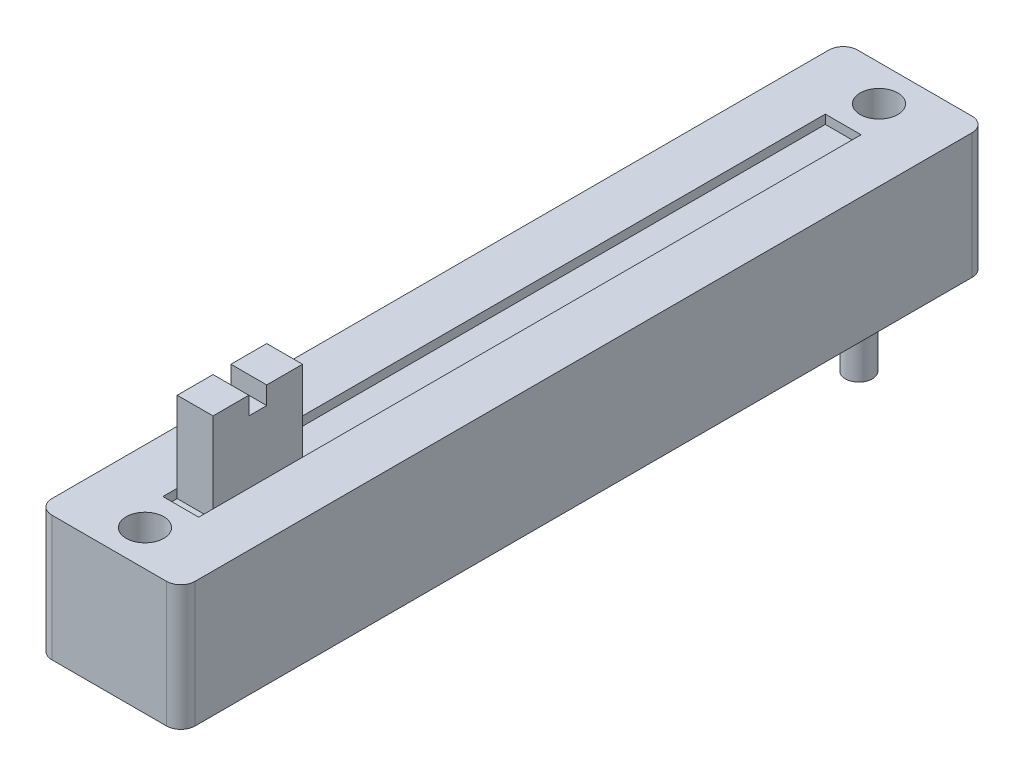
ISO-10303-21;
HEADER;
FILE_DESCRIPTION(('STEP AP214'),'2;1');
FILE_NAME('part.step','',(''),(''),'','','');
FILE_SCHEMA(('AUTOMOTIVE_DESIGN { 1 0 10303 214 1 1 1 1 }'));
ENDSEC;
DATA;
#1=APPLICATION_CONTEXT('core data for automotive mechanical design processes');
#2=APPLICATION_PROTOCOL_DEFINITION('international standard','automotive_design',2000,#1);
#3=PRODUCT_CONTEXT('',#1,'mechanical');
#4=PRODUCT('Part','Part','',(#3));
#5=PRODUCT_RELATED_PRODUCT_CATEGORY('part','',(#4));
#6=PRODUCT_DEFINITION_FORMATION('','',#4);
#7=PRODUCT_DEFINITION_CONTEXT('part definition',#1,'design');
#8=PRODUCT_DEFINITION('design','',#6,#7);
#9=PRODUCT_DEFINITION_SHAPE('','',#8);
#10=(LENGTH_UNIT() NAMED_UNIT(*) SI_UNIT(.MILLI.,.METRE.));
#11=(NAMED_UNIT(*) PLANE_ANGLE_UNIT() SI_UNIT($,.RADIAN.));
#12=(NAMED_UNIT(*) SI_UNIT($,.STERADIAN.) SOLID_ANGLE_UNIT());
#13=UNCERTAINTY_MEASURE_WITH_UNIT(LENGTH_MEASURE(1.E-05),#10,'distance_accuracy_value','');
#14=(GEOMETRIC_REPRESENTATION_CONTEXT(3) GLOBAL_UNCERTAINTY_ASSIGNED_CONTEXT((#13)) GLOBAL_UNIT_ASSIGNED_CONTEXT((#10,
#11,#12)) REPRESENTATION_CONTEXT('',''));
#15=CARTESIAN_POINT('',(0.,0.,0.));
#16=DIRECTION('',(0.,0.,1.));
#17=DIRECTION('',(1.,0.,0.));
#18=AXIS2_PLACEMENT_3D('',#15,#16,#17);
#19=CARTESIAN_POINT('',(0.,11.5,0.));
#20=DIRECTION('',(0.,-1.,0.));
#21=DIRECTION('',(0.,0.,-1.));
#22=AXIS2_PLACEMENT_3D('',#19,#20,#21);
#23=PLANE('',#22);
#24=DIRECTION('',(0.,0.,1.));
#25=VECTOR('',#24,1.);
#26=CARTESIAN_POINT('',(3.,11.5,-4.8));
#27=LINE('',#26,#25);
#28=CARTESIAN_POINT('',(3.,11.5,-9.8));
#29=VERTEX_POINT('',#28);
#30=CARTESIAN_POINT('',(3.,11.5,-7.8));
#31=VERTEX_POINT('',#30);
#32=EDGE_CURVE('E248',#29,#31,#27,.T.);
#33=ORIENTED_EDGE('',*,*,#32,.T.);
#34=DIRECTION('',(-1.,0.,0.));
#35=VECTOR('',#34,1.);
#36=CARTESIAN_POINT('',(3.,11.5,-7.8));
#37=LINE('',#36,#35);
#38=CARTESIAN_POINT('',(5.,11.5,-7.8));
#39=VERTEX_POINT('',#38);
#40=EDGE_CURVE('E207',#39,#31,#37,.T.);
#41=ORIENTED_EDGE('',*,*,#40,.F.);
#42=DIRECTION('',(0.,0.,-1.));
#43=VECTOR('',#42,1.);
#44=CARTESIAN_POINT('',(5.,11.5,-4.8));
#45=LINE('',#44,#43);
#46=CARTESIAN_POINT('',(5.,11.5,-9.8));
#47=VERTEX_POINT('',#46);
#48=EDGE_CURVE('E255',#39,#47,#45,.T.);
#49=ORIENTED_EDGE('',*,*,#48,.T.);
#50=DIRECTION('',(-1.,0.,0.));
#51=VECTOR('',#50,1.);
#52=CARTESIAN_POINT('',(3.,11.5,-9.8));
#53=LINE('',#52,#51);
#54=EDGE_CURVE('E260',#47,#29,#53,.T.);
#55=ORIENTED_EDGE('',*,*,#54,.T.);
#56=EDGE_LOOP('',(#33,#41,#49,#55));
#57=FACE_BOUND('',#56,.T.);
#58=ADVANCED_FACE('F39',(#57),#23,.F.);
#59=CARTESIAN_POINT('',(3.,6.5,-4.));
#60=DIRECTION('',(-1.,0.,0.));
#61=DIRECTION('',(0.,0.,1.));
#62=AXIS2_PLACEMENT_3D('',#59,#60,#61);
#63=PLANE('',#62);
#64=DIRECTION('',(0.,-1.,0.));
#65=VECTOR('',#64,1.);
#66=CARTESIAN_POINT('',(3.,11.5,-4.8));
#67=LINE('',#66,#65);
#68=CARTESIAN_POINT('',(3.,7.,-4.8));
#69=VERTEX_POINT('',#68);
#70=CARTESIAN_POINT('',(3.,6.5,-4.8));
#71=VERTEX_POINT('',#70);
#72=EDGE_CURVE('E285',#69,#71,#67,.T.);
#73=ORIENTED_EDGE('',*,*,#72,.F.);
#74=DIRECTION('',(0.,0.,1.));
#75=VECTOR('',#74,1.);
#76=CARTESIAN_POINT('',(3.,7.,-4.));
#77=LINE('',#76,#75);
#78=CARTESIAN_POINT('',(3.,7.,-4.));
#79=VERTEX_POINT('',#78);
#80=EDGE_CURVE('E298',#69,#79,#77,.T.);
#81=ORIENTED_EDGE('',*,*,#80,.T.);
#82=DIRECTION('',(0.,1.,0.));
#83=VECTOR('',#82,1.);
#84=CARTESIAN_POINT('',(3.,6.5,-4.));
#85=LINE('',#84,#83);
#86=CARTESIAN_POINT('',(3.,6.5,-4.));
#87=VERTEX_POINT('',#86);
#88=EDGE_CURVE('E316',#87,#79,#85,.T.);
#89=ORIENTED_EDGE('',*,*,#88,.F.);
#90=DIRECTION('',(0.,0.,1.));
#91=VECTOR('',#90,1.);
#92=CARTESIAN_POINT('',(3.,6.5,-4.));
#93=LINE('',#92,#91);
#94=EDGE_CURVE('E303',#71,#87,#93,.T.);
#95=ORIENTED_EDGE('',*,*,#94,.F.);
#96=EDGE_LOOP('',(#73,#81,#89,#95));
#97=FACE_BOUND('',#96,.T.);
#98=ADVANCED_FACE('F490',(#97),#63,.F.);
#99=DIRECTION('',(0.,-1.,0.));
#100=VECTOR('',#99,1.);
#101=CARTESIAN_POINT('',(3.,11.5,-9.8));
#102=LINE('',#101,#100);
#103=CARTESIAN_POINT('',(3.,7.,-9.8));
#104=VERTEX_POINT('',#103);
#105=CARTESIAN_POINT('',(3.,6.5,-9.8));
#106=VERTEX_POINT('',#105);
#107=EDGE_CURVE('E263',#104,#106,#102,.T.);
#108=ORIENTED_EDGE('',*,*,#107,.T.);
#109=CARTESIAN_POINT('',(3.,6.5,-41.));
#110=VERTEX_POINT('',#109);
#111=EDGE_CURVE('E299',#110,#106,#93,.T.);
#112=ORIENTED_EDGE('',*,*,#111,.F.);
#113=DIRECTION('',(0.,1.,0.));
#114=VECTOR('',#113,1.);
#115=CARTESIAN_POINT('',(3.,6.5,-41.));
#116=LINE('',#115,#114);
#117=CARTESIAN_POINT('',(3.,7.,-41.));
#118=VERTEX_POINT('',#117);
#119=EDGE_CURVE('E334',#110,#118,#116,.T.);
#120=ORIENTED_EDGE('',*,*,#119,.T.);
#121=EDGE_CURVE('E317',#118,#104,#77,.T.);
#122=ORIENTED_EDGE('',*,*,#121,.T.);
#123=EDGE_LOOP('',(#108,#112,#120,#122));
#124=FACE_BOUND('',#123,.T.);
#125=ADVANCED_FACE('F478',(#124),#63,.F.);
#126=CARTESIAN_POINT('',(5.,6.5,-4.));
#127=DIRECTION('',(1.,0.,0.));
#128=DIRECTION('',(0.,0.,-1.));
#129=AXIS2_PLACEMENT_3D('',#126,#127,#128);
#130=PLANE('',#129);
#131=DIRECTION('',(0.,-1.,0.));
#132=VECTOR('',#131,1.);
#133=CARTESIAN_POINT('',(5.,11.5,-4.8));
#134=LINE('',#133,#132);
#135=CARTESIAN_POINT('',(5.,7.,-4.8));
#136=VERTEX_POINT('',#135);
#137=CARTESIAN_POINT('',(5.,6.5,-4.8));
#138=VERTEX_POINT('',#137);
#139=EDGE_CURVE('E280',#136,#138,#134,.T.);
#140=ORIENTED_EDGE('',*,*,#139,.T.);
#141=DIRECTION('',(0.,0.,-1.));
#142=VECTOR('',#141,1.);
#143=CARTESIAN_POINT('',(5.,6.5,-4.));
#144=LINE('',#143,#142);
#145=CARTESIAN_POINT('',(5.,6.5,-4.));
#146=VERTEX_POINT('',#145);
#147=EDGE_CURVE('E308',#146,#138,#144,.T.);
#148=ORIENTED_EDGE('',*,*,#147,.F.);
#149=DIRECTION('',(0.,1.,0.));
#150=VECTOR('',#149,1.);
#151=CARTESIAN_POINT('',(5.,6.5,-4.));
#152=LINE('',#151,#150);
#153=CARTESIAN_POINT('',(5.,7.,-4.));
#154=VERTEX_POINT('',#153);
#155=EDGE_CURVE('E342',#146,#154,#152,.T.);
#156=ORIENTED_EDGE('',*,*,#155,.T.);
#157=DIRECTION('',(0.,0.,-1.));
#158=VECTOR('',#157,1.);
#159=CARTESIAN_POINT('',(5.,7.,-4.));
#160=LINE('',#159,#158);
#161=EDGE_CURVE('E326',#154,#136,#160,.T.);
#162=ORIENTED_EDGE('',*,*,#161,.T.);
#163=EDGE_LOOP('',(#140,#148,#156,#162));
#164=FACE_BOUND('',#163,.T.);
#165=ADVANCED_FACE('F558',(#164),#130,.F.);
#166=DIRECTION('',(0.,-1.,0.));
#167=VECTOR('',#166,1.);
#168=CARTESIAN_POINT('',(5.,11.5,-9.8));
#169=LINE('',#168,#167);
#170=CARTESIAN_POINT('',(5.,7.,-9.8));
#171=VERTEX_POINT('',#170);
#172=CARTESIAN_POINT('',(5.,6.5,-9.8));
#173=VERTEX_POINT('',#172);
#174=EDGE_CURVE('E275',#171,#173,#169,.T.);
#175=ORIENTED_EDGE('',*,*,#174,.F.);
#176=CARTESIAN_POINT('',(5.,7.,-41.));
#177=VERTEX_POINT('',#176);
#178=EDGE_CURVE('E325',#171,#177,#160,.T.);
#179=ORIENTED_EDGE('',*,*,#178,.T.);
#180=DIRECTION('',(0.,1.,0.));
#181=VECTOR('',#180,1.);
#182=CARTESIAN_POINT('',(5.,6.5,-41.));
#183=LINE('',#182,#181);
#184=CARTESIAN_POINT('',(5.,6.5,-41.));
#185=VERTEX_POINT('',#184);
#186=EDGE_CURVE('E338',#185,#177,#183,.T.);
#187=ORIENTED_EDGE('',*,*,#186,.F.);
#188=EDGE_CURVE('E307',#173,#185,#144,.T.);
#189=ORIENTED_EDGE('',*,*,#188,.F.);
#190=EDGE_LOOP('',(#175,#179,#187,#189));
#191=FACE_BOUND('',#190,.T.);
#192=ADVANCED_FACE('F508',(#191),#130,.F.);
#193=CARTESIAN_POINT('',(0.,6.5,0.));
#194=DIRECTION('',(0.,-1.,0.));
#195=DIRECTION('',(0.,0.,-1.));
#196=AXIS2_PLACEMENT_3D('',#193,#194,#195);
#197=PLANE('',#196);
#198=DIRECTION('',(1.,0.,0.));
#199=VECTOR('',#198,1.);
#200=CARTESIAN_POINT('',(3.,6.5,-4.8));
#201=LINE('',#200,#199);
#202=EDGE_CURVE('E244',#71,#138,#201,.T.);
#203=ORIENTED_EDGE('',*,*,#202,.F.);
#204=ORIENTED_EDGE('',*,*,#94,.T.);
#205=DIRECTION('',(1.,0.,0.));
#206=VECTOR('',#205,1.);
#207=CARTESIAN_POINT('',(3.,6.5,-4.));
#208=LINE('',#207,#206);
#209=EDGE_CURVE('E302',#87,#146,#208,.T.);
#210=ORIENTED_EDGE('',*,*,#209,.T.);
#211=ORIENTED_EDGE('',*,*,#147,.T.);
#212=EDGE_LOOP('',(#203,#204,#210,#211));
#213=FACE_BOUND('',#212,.T.);
#214=ADVANCED_FACE('F497',(#213),#197,.F.);
#215=DIRECTION('',(-1.,0.,0.));
#216=VECTOR('',#215,1.);
#217=CARTESIAN_POINT('',(3.,6.5,-9.8));
#218=LINE('',#217,#216);
#219=EDGE_CURVE('E267',#173,#106,#218,.T.);
#220=ORIENTED_EDGE('',*,*,#219,.F.);
#221=ORIENTED_EDGE('',*,*,#188,.T.);
#222=DIRECTION('',(-1.,0.,0.));
#223=VECTOR('',#222,1.);
#224=CARTESIAN_POINT('',(3.,6.5,-41.));
#225=LINE('',#224,#223);
#226=EDGE_CURVE('E312',#185,#110,#225,.T.);
#227=ORIENTED_EDGE('',*,*,#226,.T.);
#228=ORIENTED_EDGE('',*,*,#111,.T.);
#229=EDGE_LOOP('',(#220,#221,#227,#228));
#230=FACE_BOUND('',#229,.T.);
#231=ADVANCED_FACE('F512',(#230),#197,.F.);
#232=CARTESIAN_POINT('',(0.,7.,0.));
#233=DIRECTION('',(1.,0.,0.));
#234=DIRECTION('',(0.,0.,-1.));
#235=AXIS2_PLACEMENT_3D('',#232,#233,#234);
#236=PLANE('',#235);
#237=DIRECTION('',(0.,0.,1.));
#238=VECTOR('',#237,1.);
#239=CARTESIAN_POINT('',(0.,0.,0.));
#240=LINE('',#239,#238);
#241=CARTESIAN_POINT('',(0.,0.,-44.2));
#242=VERTEX_POINT('',#241);
#243=CARTESIAN_POINT('',(0.,0.,-0.8));
#244=VERTEX_POINT('',#243);
#245=EDGE_CURVE('E352',#242,#244,#240,.T.);
#246=ORIENTED_EDGE('',*,*,#245,.T.);
#247=DIRECTION('',(0.,-1.,0.));
#248=VECTOR('',#247,1.);
#249=CARTESIAN_POINT('',(0.,7.,-0.8));
#250=LINE('',#249,#248);
#251=CARTESIAN_POINT('',(0.,7.,-0.8));
#252=VERTEX_POINT('',#251);
#253=EDGE_CURVE('E416',#244,#252,#250,.F.);
#254=ORIENTED_EDGE('',*,*,#253,.T.);
#255=DIRECTION('',(0.,0.,1.));
#256=VECTOR('',#255,1.);
#257=CARTESIAN_POINT('',(0.,7.,0.));
#258=LINE('',#257,#256);
#259=CARTESIAN_POINT('',(0.,7.,-44.2));
#260=VERTEX_POINT('',#259);
#261=EDGE_CURVE('E364',#260,#252,#258,.T.);
#262=ORIENTED_EDGE('',*,*,#261,.F.);
#263=DIRECTION('',(0.,-1.,0.));
#264=VECTOR('',#263,1.);
#265=CARTESIAN_POINT('',(0.,7.,-44.2));
#266=LINE('',#265,#264);
#267=EDGE_CURVE('E412',#260,#242,#266,.T.);
#268=ORIENTED_EDGE('',*,*,#267,.T.);
#269=EDGE_LOOP('',(#246,#254,#262,#268));
#270=FACE_BOUND('',#269,.T.);
#271=ADVANCED_FACE('F557',(#270),#236,.F.);
#272=CARTESIAN_POINT('',(0.,7.,0.));
#273=DIRECTION('',(0.,0.,-1.));
#274=DIRECTION('',(-1.,0.,0.));
#275=AXIS2_PLACEMENT_3D('',#272,#273,#274);
#276=PLANE('',#275);
#277=DIRECTION('',(1.,0.,0.));
#278=VECTOR('',#277,1.);
#279=CARTESIAN_POINT('',(0.,7.,0.));
#280=LINE('',#279,#278);
#281=CARTESIAN_POINT('',(0.8,7.,0.));
#282=VERTEX_POINT('',#281);
#283=CARTESIAN_POINT('',(7.2,7.,0.));
#284=VERTEX_POINT('',#283);
#285=EDGE_CURVE('E368',#282,#284,#280,.T.);
#286=ORIENTED_EDGE('',*,*,#285,.F.);
#287=DIRECTION('',(0.,-1.,0.));
#288=VECTOR('',#287,1.);
#289=CARTESIAN_POINT('',(0.8,7.,0.));
#290=LINE('',#289,#288);
#291=CARTESIAN_POINT('',(0.8,0.,0.));
#292=VERTEX_POINT('',#291);
#293=EDGE_CURVE('E396',#282,#292,#290,.T.);
#294=ORIENTED_EDGE('',*,*,#293,.T.);
#295=DIRECTION('',(1.,0.,0.));
#296=VECTOR('',#295,1.);
#297=CARTESIAN_POINT('',(0.,0.,0.));
#298=LINE('',#297,#296);
#299=CARTESIAN_POINT('',(7.2,0.,0.));
#300=VERTEX_POINT('',#299);
#301=EDGE_CURVE('E384',#292,#300,#298,.T.);
#302=ORIENTED_EDGE('',*,*,#301,.T.);
#303=DIRECTION('',(0.,-1.,0.));
#304=VECTOR('',#303,1.);
#305=CARTESIAN_POINT('',(7.2,7.,0.));
#306=LINE('',#305,#304);
#307=EDGE_CURVE('E380',#300,#284,#306,.F.);
#308=ORIENTED_EDGE('',*,*,#307,.T.);
#309=EDGE_LOOP('',(#286,#294,#302,#308));
#310=FACE_BOUND('',#309,.T.);
#311=ADVANCED_FACE('F579',(#310),#276,.F.);
#312=CARTESIAN_POINT('',(8.,7.,0.));
#313=DIRECTION('',(-1.,0.,0.));
#314=DIRECTION('',(0.,0.,1.));
#315=AXIS2_PLACEMENT_3D('',#312,#313,#314);
#316=PLANE('',#315);
#317=DIRECTION('',(0.,0.,-1.));
#318=VECTOR('',#317,1.);
#319=CARTESIAN_POINT('',(8.,7.,0.));
#320=LINE('',#319,#318);
#321=CARTESIAN_POINT('',(8.,7.,-0.8));
#322=VERTEX_POINT('',#321);
#323=CARTESIAN_POINT('',(8.,7.,-44.2));
#324=VERTEX_POINT('',#323);
#325=EDGE_CURVE('E373',#322,#324,#320,.T.);
#326=ORIENTED_EDGE('',*,*,#325,.F.);
#327=DIRECTION('',(0.,-1.,0.));
#328=VECTOR('',#327,1.);
#329=CARTESIAN_POINT('',(8.,7.,-0.8));
#330=LINE('',#329,#328);
#331=CARTESIAN_POINT('',(8.,0.,-0.8));
#332=VERTEX_POINT('',#331);
#333=EDGE_CURVE('E434',#322,#332,#330,.T.);
#334=ORIENTED_EDGE('',*,*,#333,.T.);
#335=DIRECTION('',(0.,0.,-1.));
#336=VECTOR('',#335,1.);
#337=CARTESIAN_POINT('',(8.,0.,0.));
#338=LINE('',#337,#336);
#339=CARTESIAN_POINT('',(8.,0.,-44.2));
#340=VERTEX_POINT('',#339);
#341=EDGE_CURVE('E388',#332,#340,#338,.T.);
#342=ORIENTED_EDGE('',*,*,#341,.T.);
#343=DIRECTION('',(0.,-1.,0.));
#344=VECTOR('',#343,1.);
#345=CARTESIAN_POINT('',(8.,7.,-44.2));
#346=LINE('',#345,#344);
#347=EDGE_CURVE('E431',#340,#324,#346,.F.);
#348=ORIENTED_EDGE('',*,*,#347,.T.);
#349=EDGE_LOOP('',(#326,#334,#342,#348));
#350=FACE_BOUND('',#349,.T.);
#351=ADVANCED_FACE('F576',(#350),#316,.F.);
#352=CARTESIAN_POINT('',(0.,7.,-45.));
#353=DIRECTION('',(0.,0.,1.));
#354=DIRECTION('',(1.,0.,0.));
#355=AXIS2_PLACEMENT_3D('',#352,#353,#354);
#356=PLANE('',#355);
#357=DIRECTION('',(-1.,0.,0.));
#358=VECTOR('',#357,1.);
#359=CARTESIAN_POINT('',(0.,7.,-45.));
#360=LINE('',#359,#358);
#361=CARTESIAN_POINT('',(7.2,7.,-45.));
#362=VERTEX_POINT('',#361);
#363=CARTESIAN_POINT('',(0.8,7.,-45.));
#364=VERTEX_POINT('',#363);
#365=EDGE_CURVE('E377',#362,#364,#360,.T.);
#366=ORIENTED_EDGE('',*,*,#365,.F.);
#367=DIRECTION('',(0.,-1.,0.));
#368=VECTOR('',#367,1.);
#369=CARTESIAN_POINT('',(7.2,7.,-45.));
#370=LINE('',#369,#368);
#371=CARTESIAN_POINT('',(7.2,0.,-45.));
#372=VERTEX_POINT('',#371);
#373=EDGE_CURVE('E11',#362,#372,#370,.T.);
#374=ORIENTED_EDGE('',*,*,#373,.T.);
#375=DIRECTION('',(-1.,0.,0.));
#376=VECTOR('',#375,1.);
#377=CARTESIAN_POINT('',(0.,0.,-45.));
#378=LINE('',#377,#376);
#379=CARTESIAN_POINT('',(0.8,0.,-45.));
#380=VERTEX_POINT('',#379);
#381=EDGE_CURVE('E369',#372,#380,#378,.T.);
#382=ORIENTED_EDGE('',*,*,#381,.T.);
#383=DIRECTION('',(0.,-1.,0.));
#384=VECTOR('',#383,1.);
#385=CARTESIAN_POINT('',(0.8,7.,-45.));
#386=LINE('',#385,#384);
#387=EDGE_CURVE('E48',#380,#364,#386,.F.);
#388=ORIENTED_EDGE('',*,*,#387,.T.);
#389=EDGE_LOOP('',(#366,#374,#382,#388));
#390=FACE_BOUND('',#389,.T.);
#391=ADVANCED_FACE('F570',(#390),#356,.F.);
#392=CARTESIAN_POINT('',(0.,7.,0.));
#393=DIRECTION('',(0.,-1.,0.));
#394=DIRECTION('',(0.,0.,-1.));
#395=AXIS2_PLACEMENT_3D('',#392,#393,#394);
#396=PLANE('',#395);
#397=DIRECTION('',(1.,0.,0.));
#398=VECTOR('',#397,1.);
#399=CARTESIAN_POINT('',(3.,7.,-4.));
#400=LINE('',#399,#398);
#401=EDGE_CURVE('E321',#79,#154,#400,.T.);
#402=ORIENTED_EDGE('',*,*,#401,.F.);
#403=ORIENTED_EDGE('',*,*,#80,.F.);
#404=DIRECTION('',(0.,0.,1.));
#405=VECTOR('',#404,1.);
#406=CARTESIAN_POINT('',(3.,7.,0.));
#407=LINE('',#406,#405);
#408=EDGE_CURVE('E294',#104,#69,#407,.T.);
#409=ORIENTED_EDGE('',*,*,#408,.F.);
#410=ORIENTED_EDGE('',*,*,#121,.F.);
#411=DIRECTION('',(-1.,0.,0.));
#412=VECTOR('',#411,1.);
#413=CARTESIAN_POINT('',(3.,7.,-41.));
#414=LINE('',#413,#412);
#415=EDGE_CURVE('E330',#177,#118,#414,.T.);
#416=ORIENTED_EDGE('',*,*,#415,.F.);
#417=ORIENTED_EDGE('',*,*,#178,.F.);
#418=DIRECTION('',(0.,0.,-1.));
#419=VECTOR('',#418,1.);
#420=CARTESIAN_POINT('',(5.,7.,0.));
#421=LINE('',#420,#419);
#422=EDGE_CURVE('E290',#136,#171,#421,.T.);
#423=ORIENTED_EDGE('',*,*,#422,.F.);
#424=ORIENTED_EDGE('',*,*,#161,.F.);
#425=EDGE_LOOP('',(#402,#403,#409,#410,#416,#417,#423,#424));
#426=FACE_BOUND('',#425,.T.);
#427=CARTESIAN_POINT('',(4.,7.,-2.));
#428=DIRECTION('',(0.,1.,0.));
#429=DIRECTION('',(0.,0.,1.));
#430=AXIS2_PLACEMENT_3D('',#427,#428,#429);
#431=CIRCLE('',#430,1.05);
#432=CARTESIAN_POINT('',(4.,7.,-0.95));
#433=VERTEX_POINT('',#432);
#434=EDGE_CURVE('E353',#433,#433,#431,.T.);
#435=ORIENTED_EDGE('',*,*,#434,.F.);
#436=EDGE_LOOP('',(#435));
#437=FACE_BOUND('',#436,.T.);
#438=CARTESIAN_POINT('',(4.,7.,-43.));
#439=DIRECTION('',(0.,1.,0.));
#440=DIRECTION('',(0.,0.,1.));
#441=AXIS2_PLACEMENT_3D('',#438,#439,#440);
#442=CIRCLE('',#441,1.05);
#443=CARTESIAN_POINT('',(4.,7.,-41.95));
#444=VERTEX_POINT('',#443);
#445=EDGE_CURVE('E337',#444,#444,#442,.T.);
#446=ORIENTED_EDGE('',*,*,#445,.F.);
#447=EDGE_LOOP('',(#446));
#448=FACE_BOUND('',#447,.T.);
#449=ORIENTED_EDGE('',*,*,#261,.T.);
#450=CARTESIAN_POINT('',(0.8,7.,-0.8));
#451=DIRECTION('',(0.,-1.,0.));
#452=DIRECTION('',(0.,0.,-1.));
#453=AXIS2_PLACEMENT_3D('',#450,#451,#452);
#454=CIRCLE('',#453,0.8);
#455=EDGE_CURVE('E428',#252,#282,#454,.F.);
#456=ORIENTED_EDGE('',*,*,#455,.T.);
#457=ORIENTED_EDGE('',*,*,#285,.T.);
#458=CARTESIAN_POINT('',(7.2,7.,-0.8));
#459=DIRECTION('',(0.,-1.,0.));
#460=DIRECTION('',(0.,0.,-1.));
#461=AXIS2_PLACEMENT_3D('',#458,#459,#460);
#462=CIRCLE('',#461,0.8);
#463=EDGE_CURVE('E425',#284,#322,#462,.F.);
#464=ORIENTED_EDGE('',*,*,#463,.T.);
#465=ORIENTED_EDGE('',*,*,#325,.T.);
#466=CARTESIAN_POINT('',(7.2,7.,-44.2));
#467=DIRECTION('',(0.,-1.,0.));
#468=DIRECTION('',(0.,0.,-1.));
#469=AXIS2_PLACEMENT_3D('',#466,#467,#468);
#470=CIRCLE('',#469,0.8);
#471=EDGE_CURVE('E422',#324,#362,#470,.F.);
#472=ORIENTED_EDGE('',*,*,#471,.T.);
#473=ORIENTED_EDGE('',*,*,#365,.T.);
#474=CARTESIAN_POINT('',(0.8,7.,-44.2));
#475=DIRECTION('',(0.,-1.,0.));
#476=DIRECTION('',(0.,0.,-1.));
#477=AXIS2_PLACEMENT_3D('',#474,#475,#476);
#478=CIRCLE('',#477,0.8);
#479=EDGE_CURVE('E419',#364,#260,#478,.F.);
#480=ORIENTED_EDGE('',*,*,#479,.T.);
#481=EDGE_LOOP('',(#449,#456,#457,#464,#465,#472,#473,#480));
#482=FACE_BOUND('',#481,.T.);
#483=ADVANCED_FACE('F483',(#426,#437,#448,#482),#396,.F.);
#484=CARTESIAN_POINT('',(0.,0.,0.));
#485=DIRECTION('',(0.,-1.,0.));
#486=DIRECTION('',(0.,0.,-1.));
#487=AXIS2_PLACEMENT_3D('',#484,#485,#486);
#488=PLANE('',#487);
#489=CARTESIAN_POINT('',(2.125,0.,-5.));
#490=DIRECTION('',(0.,-1.,0.));
#491=DIRECTION('',(0.,0.,-1.));
#492=AXIS2_PLACEMENT_3D('',#489,#490,#491);
#493=CIRCLE('',#492,0.750000000000001);
#494=CARTESIAN_POINT('',(2.125,0.,-5.75000000000001));
#495=VERTEX_POINT('',#494);
#496=EDGE_CURVE('E227',#495,#495,#493,.T.);
#497=ORIENTED_EDGE('',*,*,#496,.F.);
#498=EDGE_LOOP('',(#497));
#499=FACE_BOUND('',#498,.T.);
#500=CARTESIAN_POINT('',(5.875,0.,-40.));
#501=DIRECTION('',(0.,-1.,0.));
#502=DIRECTION('',(0.,0.,-1.));
#503=AXIS2_PLACEMENT_3D('',#500,#501,#502);
#504=CIRCLE('',#503,0.75);
#505=CARTESIAN_POINT('',(5.875,0.,-40.75));
#506=VERTEX_POINT('',#505);
#507=EDGE_CURVE('E226',#506,#506,#504,.T.);
#508=ORIENTED_EDGE('',*,*,#507,.F.);
#509=EDGE_LOOP('',(#508));
#510=FACE_BOUND('',#509,.T.);
#511=CARTESIAN_POINT('',(2.125,0.,-40.));
#512=DIRECTION('',(0.,-1.,0.));
#513=DIRECTION('',(0.,0.,-1.));
#514=AXIS2_PLACEMENT_3D('',#511,#512,#513);
#515=CIRCLE('',#514,0.750000000000001);
#516=CARTESIAN_POINT('',(2.125,0.,-40.75));
#517=VERTEX_POINT('',#516);
#518=EDGE_CURVE('E236',#517,#517,#515,.T.);
#519=ORIENTED_EDGE('',*,*,#518,.F.);
#520=EDGE_LOOP('',(#519));
#521=FACE_BOUND('',#520,.T.);
#522=CARTESIAN_POINT('',(4.,0.,-2.));
#523=DIRECTION('',(0.,1.,0.));
#524=DIRECTION('',(0.,0.,1.));
#525=AXIS2_PLACEMENT_3D('',#522,#523,#524);
#526=CIRCLE('',#525,1.05);
#527=CARTESIAN_POINT('',(4.,0.,-0.95));
#528=VERTEX_POINT('',#527);
#529=EDGE_CURVE('E348',#528,#528,#526,.T.);
#530=ORIENTED_EDGE('',*,*,#529,.T.);
#531=EDGE_LOOP('',(#530));
#532=FACE_BOUND('',#531,.T.);
#533=CARTESIAN_POINT('',(4.,0.,-43.));
#534=DIRECTION('',(0.,1.,0.));
#535=DIRECTION('',(0.,0.,1.));
#536=AXIS2_PLACEMENT_3D('',#533,#534,#535);
#537=CIRCLE('',#536,1.05);
#538=CARTESIAN_POINT('',(4.,0.,-41.95));
#539=VERTEX_POINT('',#538);
#540=EDGE_CURVE('E357',#539,#539,#537,.T.);
#541=ORIENTED_EDGE('',*,*,#540,.T.);
#542=EDGE_LOOP('',(#541));
#543=FACE_BOUND('',#542,.T.);
#544=ORIENTED_EDGE('',*,*,#301,.F.);
#545=CARTESIAN_POINT('',(0.8,0.,-0.8));
#546=DIRECTION('',(0.,-1.,0.));
#547=DIRECTION('',(0.,0.,-1.));
#548=AXIS2_PLACEMENT_3D('',#545,#546,#547);
#549=CIRCLE('',#548,0.8);
#550=EDGE_CURVE('E409',#292,#244,#549,.T.);
#551=ORIENTED_EDGE('',*,*,#550,.T.);
#552=ORIENTED_EDGE('',*,*,#245,.F.);
#553=CARTESIAN_POINT('',(0.8,0.,-44.2));
#554=DIRECTION('',(0.,-1.,0.));
#555=DIRECTION('',(0.,0.,-1.));
#556=AXIS2_PLACEMENT_3D('',#553,#554,#555);
#557=CIRCLE('',#556,0.8);
#558=EDGE_CURVE('E400',#242,#380,#557,.T.);
#559=ORIENTED_EDGE('',*,*,#558,.T.);
#560=ORIENTED_EDGE('',*,*,#381,.F.);
#561=CARTESIAN_POINT('',(7.2,0.,-44.2));
#562=DIRECTION('',(0.,-1.,0.));
#563=DIRECTION('',(0.,0.,-1.));
#564=AXIS2_PLACEMENT_3D('',#561,#562,#563);
#565=CIRCLE('',#564,0.8);
#566=EDGE_CURVE('E403',#372,#340,#565,.T.);
#567=ORIENTED_EDGE('',*,*,#566,.T.);
#568=ORIENTED_EDGE('',*,*,#341,.F.);
#569=CARTESIAN_POINT('',(7.2,0.,-0.8));
#570=DIRECTION('',(0.,-1.,0.));
#571=DIRECTION('',(0.,0.,-1.));
#572=AXIS2_PLACEMENT_3D('',#569,#570,#571);
#573=CIRCLE('',#572,0.8);
#574=EDGE_CURVE('E406',#332,#300,#573,.T.);
#575=ORIENTED_EDGE('',*,*,#574,.T.);
#576=EDGE_LOOP('',(#544,#551,#552,#559,#560,#567,#568,#575));
#577=FACE_BOUND('',#576,.T.);
#578=ADVANCED_FACE('F566',(#499,#510,#521,#532,#543,#577),#488,.T.);
#579=CARTESIAN_POINT('',(4.,0.,-43.));
#580=DIRECTION('',(0.,1.,0.));
#581=DIRECTION('',(0.,0.,1.));
#582=AXIS2_PLACEMENT_3D('',#579,#580,#581);
#583=CYLINDRICAL_SURFACE('',#582,1.05);
#584=ORIENTED_EDGE('',*,*,#540,.F.);
#585=EDGE_LOOP('',(#584));
#586=FACE_BOUND('',#585,.T.);
#587=ORIENTED_EDGE('',*,*,#445,.T.);
#588=EDGE_LOOP('',(#587));
#589=FACE_BOUND('',#588,.T.);
#590=ADVANCED_FACE('F523',(#586,#589),#583,.F.);
#591=CARTESIAN_POINT('',(4.,0.,-2.));
#592=DIRECTION('',(0.,1.,0.));
#593=DIRECTION('',(0.,0.,1.));
#594=AXIS2_PLACEMENT_3D('',#591,#592,#593);
#595=CYLINDRICAL_SURFACE('',#594,1.05);
#596=ORIENTED_EDGE('',*,*,#529,.F.);
#597=EDGE_LOOP('',(#596));
#598=FACE_BOUND('',#597,.T.);
#599=ORIENTED_EDGE('',*,*,#434,.T.);
#600=EDGE_LOOP('',(#599));
#601=FACE_BOUND('',#600,.T.);
#602=ADVANCED_FACE('F516',(#598,#601),#595,.F.);
#603=CARTESIAN_POINT('',(3.,6.5,-41.));
#604=DIRECTION('',(0.,0.,-1.));
#605=DIRECTION('',(-1.,0.,0.));
#606=AXIS2_PLACEMENT_3D('',#603,#604,#605);
#607=PLANE('',#606);
#608=ORIENTED_EDGE('',*,*,#415,.T.);
#609=ORIENTED_EDGE('',*,*,#119,.F.);
#610=ORIENTED_EDGE('',*,*,#226,.F.);
#611=ORIENTED_EDGE('',*,*,#186,.T.);
#612=EDGE_LOOP('',(#608,#609,#610,#611));
#613=FACE_BOUND('',#612,.T.);
#614=ADVANCED_FACE('F514',(#613),#607,.F.);
#615=CARTESIAN_POINT('',(3.,6.5,-4.));
#616=DIRECTION('',(0.,0.,1.));
#617=DIRECTION('',(1.,0.,0.));
#618=AXIS2_PLACEMENT_3D('',#615,#616,#617);
#619=PLANE('',#618);
#620=ORIENTED_EDGE('',*,*,#401,.T.);
#621=ORIENTED_EDGE('',*,*,#155,.F.);
#622=ORIENTED_EDGE('',*,*,#209,.F.);
#623=ORIENTED_EDGE('',*,*,#88,.T.);
#624=EDGE_LOOP('',(#620,#621,#622,#623));
#625=FACE_BOUND('',#624,.T.);
#626=ADVANCED_FACE('F494',(#625),#619,.F.);
#627=CARTESIAN_POINT('',(3.,11.5,-4.8));
#628=DIRECTION('',(1.,0.,0.));
#629=DIRECTION('',(0.,0.,-1.));
#630=AXIS2_PLACEMENT_3D('',#627,#628,#629);
#631=PLANE('',#630);
#632=DIRECTION('',(0.,0.,1.));
#633=VECTOR('',#632,1.);
#634=CARTESIAN_POINT('',(3.,10.5,-6.8));
#635=LINE('',#634,#633);
#636=CARTESIAN_POINT('',(3.,10.5,-7.8));
#637=VERTEX_POINT('',#636);
#638=CARTESIAN_POINT('',(3.,10.5,-6.8));
#639=VERTEX_POINT('',#638);
#640=EDGE_CURVE('E197',#637,#639,#635,.T.);
#641=ORIENTED_EDGE('',*,*,#640,.F.);
#642=DIRECTION('',(0.,1.,0.));
#643=VECTOR('',#642,1.);
#644=CARTESIAN_POINT('',(3.,10.5,-7.8));
#645=LINE('',#644,#643);
#646=EDGE_CURVE('E231',#637,#31,#645,.T.);
#647=ORIENTED_EDGE('',*,*,#646,.T.);
#648=ORIENTED_EDGE('',*,*,#32,.F.);
#649=EDGE_CURVE('E271',#29,#104,#102,.T.);
#650=ORIENTED_EDGE('',*,*,#649,.T.);
#651=ORIENTED_EDGE('',*,*,#408,.T.);
#652=CARTESIAN_POINT('',(3.,11.5,-4.8));
#653=VERTEX_POINT('',#652);
#654=EDGE_CURVE('E286',#653,#69,#67,.T.);
#655=ORIENTED_EDGE('',*,*,#654,.F.);
#656=CARTESIAN_POINT('',(3.,11.5,-6.8));
#657=VERTEX_POINT('',#656);
#658=EDGE_CURVE('E212',#657,#653,#27,.T.);
#659=ORIENTED_EDGE('',*,*,#658,.F.);
#660=DIRECTION('',(0.,1.,0.));
#661=VECTOR('',#660,1.);
#662=CARTESIAN_POINT('',(3.,10.5,-6.8));
#663=LINE('',#662,#661);
#664=EDGE_CURVE('E55',#639,#657,#663,.T.);
#665=ORIENTED_EDGE('',*,*,#664,.F.);
#666=EDGE_LOOP('',(#641,#647,#648,#650,#651,#655,#659,#665));
#667=FACE_BOUND('',#666,.T.);
#668=ADVANCED_FACE('F210',(#667),#631,.F.);
#669=CARTESIAN_POINT('',(5.,11.5,-4.8));
#670=DIRECTION('',(-1.,0.,0.));
#671=DIRECTION('',(0.,0.,1.));
#672=AXIS2_PLACEMENT_3D('',#669,#670,#671);
#673=PLANE('',#672);
#674=ORIENTED_EDGE('',*,*,#48,.F.);
#675=DIRECTION('',(0.,1.,0.));
#676=VECTOR('',#675,1.);
#677=CARTESIAN_POINT('',(5.,10.5,-7.8));
#678=LINE('',#677,#676);
#679=CARTESIAN_POINT('',(5.,10.5,-7.8));
#680=VERTEX_POINT('',#679);
#681=EDGE_CURVE('E217',#680,#39,#678,.T.);
#682=ORIENTED_EDGE('',*,*,#681,.F.);
#683=DIRECTION('',(0.,0.,-1.));
#684=VECTOR('',#683,1.);
#685=CARTESIAN_POINT('',(5.,10.5,-6.8));
#686=LINE('',#685,#684);
#687=CARTESIAN_POINT('',(5.,10.5,-6.8));
#688=VERTEX_POINT('',#687);
#689=EDGE_CURVE('E196',#688,#680,#686,.T.);
#690=ORIENTED_EDGE('',*,*,#689,.F.);
#691=DIRECTION('',(0.,1.,0.));
#692=VECTOR('',#691,1.);
#693=CARTESIAN_POINT('',(5.,10.5,-6.8));
#694=LINE('',#693,#692);
#695=CARTESIAN_POINT('',(5.,11.5,-6.8));
#696=VERTEX_POINT('',#695);
#697=EDGE_CURVE('E192',#688,#696,#694,.T.);
#698=ORIENTED_EDGE('',*,*,#697,.T.);
#699=CARTESIAN_POINT('',(5.,11.5,-4.8));
#700=VERTEX_POINT('',#699);
#701=EDGE_CURVE('E256',#700,#696,#45,.T.);
#702=ORIENTED_EDGE('',*,*,#701,.F.);
#703=EDGE_CURVE('E281',#700,#136,#134,.T.);
#704=ORIENTED_EDGE('',*,*,#703,.T.);
#705=ORIENTED_EDGE('',*,*,#422,.T.);
#706=EDGE_CURVE('E276',#47,#171,#169,.T.);
#707=ORIENTED_EDGE('',*,*,#706,.F.);
#708=EDGE_LOOP('',(#674,#682,#690,#698,#702,#704,#705,#707));
#709=FACE_BOUND('',#708,.T.);
#710=ADVANCED_FACE('F467',(#709),#673,.F.);
#711=CARTESIAN_POINT('',(3.,11.5,-4.8));
#712=DIRECTION('',(0.,0.,-1.));
#713=DIRECTION('',(-1.,0.,0.));
#714=AXIS2_PLACEMENT_3D('',#711,#712,#713);
#715=PLANE('',#714);
#716=ORIENTED_EDGE('',*,*,#202,.T.);
#717=ORIENTED_EDGE('',*,*,#139,.F.);
#718=ORIENTED_EDGE('',*,*,#703,.F.);
#719=DIRECTION('',(1.,0.,0.));
#720=VECTOR('',#719,1.);
#721=CARTESIAN_POINT('',(3.,11.5,-4.8));
#722=LINE('',#721,#720);
#723=EDGE_CURVE('E252',#653,#700,#722,.T.);
#724=ORIENTED_EDGE('',*,*,#723,.F.);
#725=ORIENTED_EDGE('',*,*,#654,.T.);
#726=ORIENTED_EDGE('',*,*,#72,.T.);
#727=EDGE_LOOP('',(#716,#717,#718,#724,#725,#726));
#728=FACE_BOUND('',#727,.T.);
#729=ADVANCED_FACE('F499',(#728),#715,.F.);
#730=CARTESIAN_POINT('',(3.,11.5,-9.8));
#731=DIRECTION('',(0.,0.,1.));
#732=DIRECTION('',(1.,0.,0.));
#733=AXIS2_PLACEMENT_3D('',#730,#731,#732);
#734=PLANE('',#733);
#735=ORIENTED_EDGE('',*,*,#219,.T.);
#736=ORIENTED_EDGE('',*,*,#107,.F.);
#737=ORIENTED_EDGE('',*,*,#649,.F.);
#738=ORIENTED_EDGE('',*,*,#54,.F.);
#739=ORIENTED_EDGE('',*,*,#706,.T.);
#740=ORIENTED_EDGE('',*,*,#174,.T.);
#741=EDGE_LOOP('',(#735,#736,#737,#738,#739,#740));
#742=FACE_BOUND('',#741,.T.);
#743=ADVANCED_FACE('F475',(#742),#734,.F.);
#744=ORIENTED_EDGE('',*,*,#701,.T.);
#745=DIRECTION('',(1.,0.,0.));
#746=VECTOR('',#745,1.);
#747=CARTESIAN_POINT('',(3.,11.5,-6.8));
#748=LINE('',#747,#746);
#749=EDGE_CURVE('E460',#657,#696,#748,.T.);
#750=ORIENTED_EDGE('',*,*,#749,.F.);
#751=ORIENTED_EDGE('',*,*,#658,.T.);
#752=ORIENTED_EDGE('',*,*,#723,.T.);
#753=EDGE_LOOP('',(#744,#750,#751,#752));
#754=FACE_BOUND('',#753,.T.);
#755=ADVANCED_FACE('F505',(#754),#23,.F.);
#756=CARTESIAN_POINT('',(2.125,-3.5,-40.));
#757=DIRECTION('',(0.,1.,0.));
#758=DIRECTION('',(0.,0.,1.));
#759=AXIS2_PLACEMENT_3D('',#756,#757,#758);
#760=CYLINDRICAL_SURFACE('',#759,0.750000000000001);
#761=CARTESIAN_POINT('',(2.125,-3.5,-40.));
#762=DIRECTION('',(0.,-1.,0.));
#763=DIRECTION('',(0.,0.,-1.));
#764=AXIS2_PLACEMENT_3D('',#761,#762,#763);
#765=CIRCLE('',#764,0.750000000000001);
#766=CARTESIAN_POINT('',(2.125,-3.5,-40.75));
#767=VERTEX_POINT('',#766);
#768=EDGE_CURVE('E240',#767,#767,#765,.T.);
#769=ORIENTED_EDGE('',*,*,#768,.F.);
#770=EDGE_LOOP('',(#769));
#771=FACE_BOUND('',#770,.T.);
#772=ORIENTED_EDGE('',*,*,#518,.T.);
#773=EDGE_LOOP('',(#772));
#774=FACE_BOUND('',#773,.T.);
#775=ADVANCED_FACE('F537',(#771,#774),#760,.T.);
#776=CARTESIAN_POINT('',(2.125,-3.5,-40.));
#777=DIRECTION('',(0.,-1.,0.));
#778=DIRECTION('',(0.,0.,-1.));
#779=AXIS2_PLACEMENT_3D('',#776,#777,#778);
#780=PLANE('',#779);
#781=ORIENTED_EDGE('',*,*,#768,.T.);
#782=EDGE_LOOP('',(#781));
#783=FACE_BOUND('',#782,.T.);
#784=ADVANCED_FACE('F542',(#783),#780,.T.);
#785=CARTESIAN_POINT('',(5.875,-3.5,-40.));
#786=DIRECTION('',(0.,1.,0.));
#787=DIRECTION('',(0.,0.,1.));
#788=AXIS2_PLACEMENT_3D('',#785,#786,#787);
#789=CYLINDRICAL_SURFACE('',#788,0.75);
#790=CARTESIAN_POINT('',(5.875,-3.5,-40.));
#791=DIRECTION('',(0.,-1.,0.));
#792=DIRECTION('',(0.,0.,-1.));
#793=AXIS2_PLACEMENT_3D('',#790,#791,#792);
#794=CIRCLE('',#793,0.75);
#795=CARTESIAN_POINT('',(5.875,-3.5,-40.75));
#796=VERTEX_POINT('',#795);
#797=EDGE_CURVE('E232',#796,#796,#794,.T.);
#798=ORIENTED_EDGE('',*,*,#797,.F.);
#799=EDGE_LOOP('',(#798));
#800=FACE_BOUND('',#799,.T.);
#801=ORIENTED_EDGE('',*,*,#507,.T.);
#802=EDGE_LOOP('',(#801));
#803=FACE_BOUND('',#802,.T.);
#804=ADVANCED_FACE('F642',(#800,#803),#789,.T.);
#805=CARTESIAN_POINT('',(5.875,-3.5,-40.));
#806=DIRECTION('',(0.,-1.,0.));
#807=DIRECTION('',(0.,0.,-1.));
#808=AXIS2_PLACEMENT_3D('',#805,#806,#807);
#809=PLANE('',#808);
#810=ORIENTED_EDGE('',*,*,#797,.T.);
#811=EDGE_LOOP('',(#810));
#812=FACE_BOUND('',#811,.T.);
#813=ADVANCED_FACE('F638',(#812),#809,.T.);
#814=CARTESIAN_POINT('',(2.125,-3.5,-5.));
#815=DIRECTION('',(0.,1.,0.));
#816=DIRECTION('',(0.,0.,1.));
#817=AXIS2_PLACEMENT_3D('',#814,#815,#816);
#818=CYLINDRICAL_SURFACE('',#817,0.750000000000001);
#819=CARTESIAN_POINT('',(2.125,-3.5,-5.));
#820=DIRECTION('',(0.,-1.,0.));
#821=DIRECTION('',(0.,0.,-1.));
#822=AXIS2_PLACEMENT_3D('',#819,#820,#821);
#823=CIRCLE('',#822,0.750000000000001);
#824=CARTESIAN_POINT('',(2.125,-3.5,-5.75000000000001));
#825=VERTEX_POINT('',#824);
#826=EDGE_CURVE('E222',#825,#825,#823,.T.);
#827=ORIENTED_EDGE('',*,*,#826,.F.);
#828=EDGE_LOOP('',(#827));
#829=FACE_BOUND('',#828,.T.);
#830=ORIENTED_EDGE('',*,*,#496,.T.);
#831=EDGE_LOOP('',(#830));
#832=FACE_BOUND('',#831,.T.);
#833=ADVANCED_FACE('F634',(#829,#832),#818,.T.);
#834=CARTESIAN_POINT('',(2.125,-3.5,-5.));
#835=DIRECTION('',(0.,-1.,0.));
#836=DIRECTION('',(0.,0.,-1.));
#837=AXIS2_PLACEMENT_3D('',#834,#835,#836);
#838=PLANE('',#837);
#839=ORIENTED_EDGE('',*,*,#826,.T.);
#840=EDGE_LOOP('',(#839));
#841=FACE_BOUND('',#840,.T.);
#842=ADVANCED_FACE('F591',(#841),#838,.T.);
#843=CARTESIAN_POINT('',(0.8,7.,-0.8));
#844=DIRECTION('',(0.,-1.,0.));
#845=DIRECTION('',(0.,0.,-1.));
#846=AXIS2_PLACEMENT_3D('',#843,#844,#845);
#847=CYLINDRICAL_SURFACE('',#846,0.8);
#848=ORIENTED_EDGE('',*,*,#455,.F.);
#849=ORIENTED_EDGE('',*,*,#253,.F.);
#850=ORIENTED_EDGE('',*,*,#550,.F.);
#851=ORIENTED_EDGE('',*,*,#293,.F.);
#852=EDGE_LOOP('',(#848,#849,#850,#851));
#853=FACE_BOUND('',#852,.T.);
#854=ADVANCED_FACE('F587',(#853),#847,.T.);
#855=CARTESIAN_POINT('',(7.2,7.,-0.8));
#856=DIRECTION('',(0.,-1.,0.));
#857=DIRECTION('',(0.,0.,-1.));
#858=AXIS2_PLACEMENT_3D('',#855,#856,#857);
#859=CYLINDRICAL_SURFACE('',#858,0.8);
#860=ORIENTED_EDGE('',*,*,#463,.F.);
#861=ORIENTED_EDGE('',*,*,#307,.F.);
#862=ORIENTED_EDGE('',*,*,#574,.F.);
#863=ORIENTED_EDGE('',*,*,#333,.F.);
#864=EDGE_LOOP('',(#860,#861,#862,#863));
#865=FACE_BOUND('',#864,.T.);
#866=ADVANCED_FACE('F590',(#865),#859,.T.);
#867=CARTESIAN_POINT('',(7.2,7.,-44.2));
#868=DIRECTION('',(0.,-1.,0.));
#869=DIRECTION('',(0.,0.,-1.));
#870=AXIS2_PLACEMENT_3D('',#867,#868,#869);
#871=CYLINDRICAL_SURFACE('',#870,0.8);
#872=ORIENTED_EDGE('',*,*,#471,.F.);
#873=ORIENTED_EDGE('',*,*,#347,.F.);
#874=ORIENTED_EDGE('',*,*,#566,.F.);
#875=ORIENTED_EDGE('',*,*,#373,.F.);
#876=EDGE_LOOP('',(#872,#873,#874,#875));
#877=FACE_BOUND('',#876,.T.);
#878=ADVANCED_FACE('F594',(#877),#871,.T.);
#879=CARTESIAN_POINT('',(0.8,7.,-44.2));
#880=DIRECTION('',(0.,-1.,0.));
#881=DIRECTION('',(0.,0.,-1.));
#882=AXIS2_PLACEMENT_3D('',#879,#880,#881);
#883=CYLINDRICAL_SURFACE('',#882,0.8);
#884=ORIENTED_EDGE('',*,*,#479,.F.);
#885=ORIENTED_EDGE('',*,*,#387,.F.);
#886=ORIENTED_EDGE('',*,*,#558,.F.);
#887=ORIENTED_EDGE('',*,*,#267,.F.);
#888=EDGE_LOOP('',(#884,#885,#886,#887));
#889=FACE_BOUND('',#888,.T.);
#890=ADVANCED_FACE('F41',(#889),#883,.T.);
#891=CARTESIAN_POINT('',(3.,10.5,-7.8));
#892=DIRECTION('',(0.,0.,-1.));
#893=DIRECTION('',(-1.,0.,0.));
#894=AXIS2_PLACEMENT_3D('',#891,#892,#893);
#895=PLANE('',#894);
#896=ORIENTED_EDGE('',*,*,#40,.T.);
#897=ORIENTED_EDGE('',*,*,#646,.F.);
#898=DIRECTION('',(-1.,0.,0.));
#899=VECTOR('',#898,1.);
#900=CARTESIAN_POINT('',(3.,10.5,-7.8));
#901=LINE('',#900,#899);
#902=EDGE_CURVE('E203',#680,#637,#901,.T.);
#903=ORIENTED_EDGE('',*,*,#902,.F.);
#904=ORIENTED_EDGE('',*,*,#681,.T.);
#905=EDGE_LOOP('',(#896,#897,#903,#904));
#906=FACE_BOUND('',#905,.T.);
#907=ADVANCED_FACE('F465',(#906),#895,.F.);
#908=CARTESIAN_POINT('',(3.,10.5,-6.8));
#909=DIRECTION('',(0.,0.,1.));
#910=DIRECTION('',(1.,0.,0.));
#911=AXIS2_PLACEMENT_3D('',#908,#909,#910);
#912=PLANE('',#911);
#913=ORIENTED_EDGE('',*,*,#749,.T.);
#914=ORIENTED_EDGE('',*,*,#697,.F.);
#915=DIRECTION('',(1.,0.,0.));
#916=VECTOR('',#915,1.);
#917=CARTESIAN_POINT('',(3.,10.5,-6.8));
#918=LINE('',#917,#916);
#919=EDGE_CURVE('E188',#639,#688,#918,.T.);
#920=ORIENTED_EDGE('',*,*,#919,.F.);
#921=ORIENTED_EDGE('',*,*,#664,.T.);
#922=EDGE_LOOP('',(#913,#914,#920,#921));
#923=FACE_BOUND('',#922,.T.);
#924=ADVANCED_FACE('F190',(#923),#912,.F.);
#925=CARTESIAN_POINT('',(0.,10.5,0.));
#926=DIRECTION('',(0.,-1.,0.));
#927=DIRECTION('',(0.,0.,-1.));
#928=AXIS2_PLACEMENT_3D('',#925,#926,#927);
#929=PLANE('',#928);
#930=ORIENTED_EDGE('',*,*,#640,.T.);
#931=ORIENTED_EDGE('',*,*,#919,.T.);
#932=ORIENTED_EDGE('',*,*,#689,.T.);
#933=ORIENTED_EDGE('',*,*,#902,.T.);
#934=EDGE_LOOP('',(#930,#931,#932,#933));
#935=FACE_BOUND('',#934,.T.);
#936=ADVANCED_FACE('F201',(#935),#929,.F.);
#937=CLOSED_SHELL('',(#58,#98,#125,#165,#192,#214,#231,#271,#311,#351,#391,#483,#578,#590,#602,
#614,#626,#668,#710,#729,#743,#755,#775,#784,#804,#813,#833,#842,#854,#866,#878,#890,#907,#924,#936));
#938=MANIFOLD_SOLID_BREP('B2',#937);
#939=ADVANCED_BREP_SHAPE_REPRESENTATION('',(#18,#938),#14);
#940=SHAPE_DEFINITION_REPRESENTATION(#9,#939);
ENDSEC;
END-ISO-10303-21;
